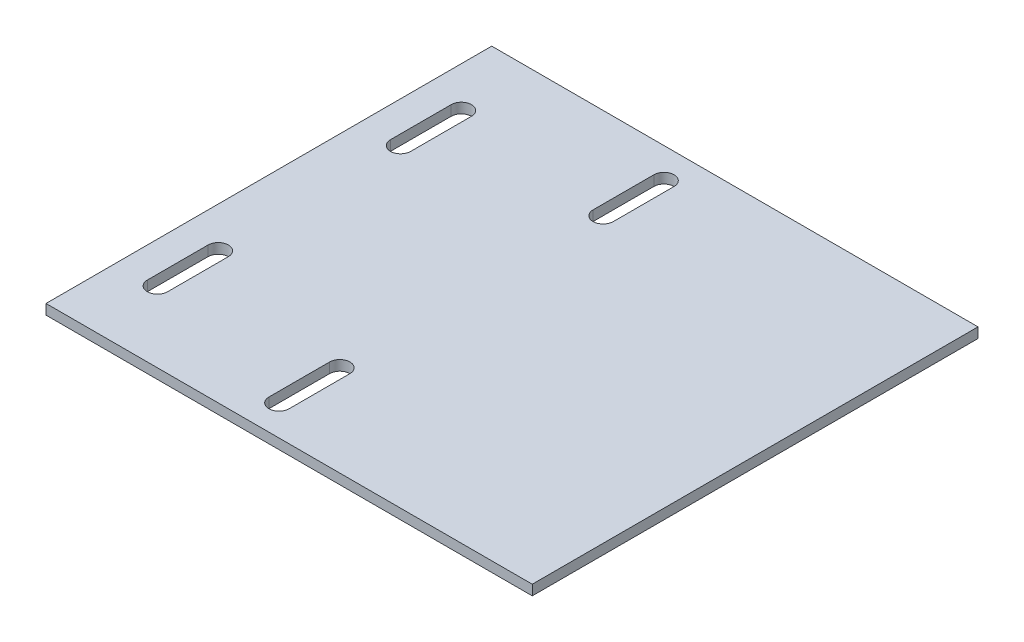
ISO-10303-21;
HEADER;
FILE_DESCRIPTION(('STEP AP214'),'2;1');
FILE_NAME('part.step','',(''),(''),'','','');
FILE_SCHEMA(('AUTOMOTIVE_DESIGN { 1 0 10303 214 1 1 1 1 }'));
ENDSEC;
DATA;
#1=APPLICATION_CONTEXT('core data for automotive mechanical design processes');
#2=APPLICATION_PROTOCOL_DEFINITION('international standard','automotive_design',2000,#1);
#3=PRODUCT_CONTEXT('',#1,'mechanical');
#4=PRODUCT('Part','Part','',(#3));
#5=PRODUCT_RELATED_PRODUCT_CATEGORY('part','',(#4));
#6=PRODUCT_DEFINITION_FORMATION('','',#4);
#7=PRODUCT_DEFINITION_CONTEXT('part definition',#1,'design');
#8=PRODUCT_DEFINITION('design','',#6,#7);
#9=PRODUCT_DEFINITION_SHAPE('','',#8);
#10=(LENGTH_UNIT() NAMED_UNIT(*) SI_UNIT(.MILLI.,.METRE.));
#11=(NAMED_UNIT(*) PLANE_ANGLE_UNIT() SI_UNIT($,.RADIAN.));
#12=(NAMED_UNIT(*) SI_UNIT($,.STERADIAN.) SOLID_ANGLE_UNIT());
#13=UNCERTAINTY_MEASURE_WITH_UNIT(LENGTH_MEASURE(1.E-05),#10,'distance_accuracy_value','');
#14=(GEOMETRIC_REPRESENTATION_CONTEXT(3) GLOBAL_UNCERTAINTY_ASSIGNED_CONTEXT((#13)) GLOBAL_UNIT_ASSIGNED_CONTEXT((#10,
#11,#12)) REPRESENTATION_CONTEXT('',''));
#15=CARTESIAN_POINT('',(0.,0.,0.));
#16=DIRECTION('',(0.,0.,1.));
#17=DIRECTION('',(1.,0.,0.));
#18=AXIS2_PLACEMENT_3D('',#15,#16,#17);
#19=CARTESIAN_POINT('',(-76.2,3.175,-69.85));
#20=DIRECTION('',(1.,0.,0.));
#21=DIRECTION('',(0.,0.,-1.));
#22=AXIS2_PLACEMENT_3D('',#19,#20,#21);
#23=PLANE('',#22);
#24=DIRECTION('',(0.,0.,1.));
#25=VECTOR('',#24,1.);
#26=CARTESIAN_POINT('',(-76.2,0.,-69.85));
#27=LINE('',#26,#25);
#28=CARTESIAN_POINT('',(-76.2,0.,-69.85));
#29=VERTEX_POINT('',#28);
#30=CARTESIAN_POINT('',(-76.2,0.,69.85));
#31=VERTEX_POINT('',#30);
#32=EDGE_CURVE('E295',#29,#31,#27,.T.);
#33=ORIENTED_EDGE('',*,*,#32,.T.);
#34=DIRECTION('',(0.,-1.,0.));
#35=VECTOR('',#34,1.);
#36=CARTESIAN_POINT('',(-76.2,3.175,69.85));
#37=LINE('',#36,#35);
#38=CARTESIAN_POINT('',(-76.2,3.175,69.85));
#39=VERTEX_POINT('',#38);
#40=EDGE_CURVE('E11',#39,#31,#37,.T.);
#41=ORIENTED_EDGE('',*,*,#40,.F.);
#42=DIRECTION('',(0.,0.,1.));
#43=VECTOR('',#42,1.);
#44=CARTESIAN_POINT('',(-76.2,3.175,-69.85));
#45=LINE('',#44,#43);
#46=CARTESIAN_POINT('',(-76.2,3.175,-69.85));
#47=VERTEX_POINT('',#46);
#48=EDGE_CURVE('E302',#47,#39,#45,.T.);
#49=ORIENTED_EDGE('',*,*,#48,.F.);
#50=DIRECTION('',(0.,-1.,0.));
#51=VECTOR('',#50,1.);
#52=CARTESIAN_POINT('',(-76.2,3.175,-69.85));
#53=LINE('',#52,#51);
#54=EDGE_CURVE('E312',#47,#29,#53,.T.);
#55=ORIENTED_EDGE('',*,*,#54,.T.);
#56=EDGE_LOOP('',(#33,#41,#49,#55));
#57=FACE_BOUND('',#56,.T.);
#58=ADVANCED_FACE('F34',(#57),#23,.F.);
#59=CARTESIAN_POINT('',(76.2,3.175,69.85));
#60=DIRECTION('',(0.,0.,-1.));
#61=DIRECTION('',(-1.,0.,0.));
#62=AXIS2_PLACEMENT_3D('',#59,#60,#61);
#63=PLANE('',#62);
#64=DIRECTION('',(1.,0.,0.));
#65=VECTOR('',#64,1.);
#66=CARTESIAN_POINT('',(76.2,0.,69.85));
#67=LINE('',#66,#65);
#68=CARTESIAN_POINT('',(76.2,0.,69.85));
#69=VERTEX_POINT('',#68);
#70=EDGE_CURVE('E315',#31,#69,#67,.T.);
#71=ORIENTED_EDGE('',*,*,#70,.T.);
#72=DIRECTION('',(0.,-1.,0.));
#73=VECTOR('',#72,1.);
#74=CARTESIAN_POINT('',(76.2,3.175,69.85));
#75=LINE('',#74,#73);
#76=CARTESIAN_POINT('',(76.2,3.175,69.85));
#77=VERTEX_POINT('',#76);
#78=EDGE_CURVE('E41',#77,#69,#75,.T.);
#79=ORIENTED_EDGE('',*,*,#78,.F.);
#80=DIRECTION('',(1.,0.,0.));
#81=VECTOR('',#80,1.);
#82=CARTESIAN_POINT('',(76.2,3.175,69.85));
#83=LINE('',#82,#81);
#84=EDGE_CURVE('E305',#39,#77,#83,.T.);
#85=ORIENTED_EDGE('',*,*,#84,.F.);
#86=ORIENTED_EDGE('',*,*,#40,.T.);
#87=EDGE_LOOP('',(#71,#79,#85,#86));
#88=FACE_BOUND('',#87,.T.);
#89=ADVANCED_FACE('F344',(#88),#63,.F.);
#90=CARTESIAN_POINT('',(76.2,3.175,-69.85));
#91=DIRECTION('',(-1.,0.,0.));
#92=DIRECTION('',(0.,0.,1.));
#93=AXIS2_PLACEMENT_3D('',#90,#91,#92);
#94=PLANE('',#93);
#95=DIRECTION('',(0.,0.,-1.));
#96=VECTOR('',#95,1.);
#97=CARTESIAN_POINT('',(76.2,0.,-69.85));
#98=LINE('',#97,#96);
#99=CARTESIAN_POINT('',(76.2,0.,-69.85));
#100=VERTEX_POINT('',#99);
#101=EDGE_CURVE('E317',#69,#100,#98,.T.);
#102=ORIENTED_EDGE('',*,*,#101,.T.);
#103=DIRECTION('',(0.,-1.,0.));
#104=VECTOR('',#103,1.);
#105=CARTESIAN_POINT('',(76.2,3.175,-69.85));
#106=LINE('',#105,#104);
#107=CARTESIAN_POINT('',(76.2,3.175,-69.85));
#108=VERTEX_POINT('',#107);
#109=EDGE_CURVE('E322',#108,#100,#106,.T.);
#110=ORIENTED_EDGE('',*,*,#109,.F.);
#111=DIRECTION('',(0.,0.,-1.));
#112=VECTOR('',#111,1.);
#113=CARTESIAN_POINT('',(76.2,3.175,-69.85));
#114=LINE('',#113,#112);
#115=EDGE_CURVE('E308',#77,#108,#114,.T.);
#116=ORIENTED_EDGE('',*,*,#115,.F.);
#117=ORIENTED_EDGE('',*,*,#78,.T.);
#118=EDGE_LOOP('',(#102,#110,#116,#117));
#119=FACE_BOUND('',#118,.T.);
#120=ADVANCED_FACE('F329',(#119),#94,.F.);
#121=CARTESIAN_POINT('',(76.2,3.175,-69.85));
#122=DIRECTION('',(0.,0.,1.));
#123=DIRECTION('',(1.,0.,0.));
#124=AXIS2_PLACEMENT_3D('',#121,#122,#123);
#125=PLANE('',#124);
#126=DIRECTION('',(-1.,0.,0.));
#127=VECTOR('',#126,1.);
#128=CARTESIAN_POINT('',(76.2,0.,-69.85));
#129=LINE('',#128,#127);
#130=EDGE_CURVE('E306',#100,#29,#129,.T.);
#131=ORIENTED_EDGE('',*,*,#130,.T.);
#132=ORIENTED_EDGE('',*,*,#54,.F.);
#133=DIRECTION('',(-1.,0.,0.));
#134=VECTOR('',#133,1.);
#135=CARTESIAN_POINT('',(76.2,3.175,-69.85));
#136=LINE('',#135,#134);
#137=EDGE_CURVE('E310',#108,#47,#136,.T.);
#138=ORIENTED_EDGE('',*,*,#137,.F.);
#139=ORIENTED_EDGE('',*,*,#109,.T.);
#140=EDGE_LOOP('',(#131,#132,#138,#139));
#141=FACE_BOUND('',#140,.T.);
#142=ADVANCED_FACE('F337',(#141),#125,.F.);
#143=CARTESIAN_POINT('',(-76.1999999999999,3.175,69.85));
#144=DIRECTION('',(0.,-1.,0.));
#145=DIRECTION('',(0.,0.,-1.));
#146=AXIS2_PLACEMENT_3D('',#143,#144,#145);
#147=PLANE('',#146);
#148=CARTESIAN_POINT('',(-63.5,3.175,-28.575));
#149=DIRECTION('',(0.,1.,0.));
#150=DIRECTION('',(0.,0.,1.));
#151=AXIS2_PLACEMENT_3D('',#148,#149,#150);
#152=CIRCLE('',#151,3.175);
#153=CARTESIAN_POINT('',(-66.675,3.175,-28.575));
#154=VERTEX_POINT('',#153);
#155=CARTESIAN_POINT('',(-60.325,3.175,-28.575));
#156=VERTEX_POINT('',#155);
#157=EDGE_CURVE('E196',#154,#156,#152,.T.);
#158=ORIENTED_EDGE('',*,*,#157,.F.);
#159=DIRECTION('',(0.,0.,1.));
#160=VECTOR('',#159,1.);
#161=CARTESIAN_POINT('',(-66.675,3.175,0.));
#162=LINE('',#161,#160);
#163=CARTESIAN_POINT('',(-66.675,3.175,-47.625));
#164=VERTEX_POINT('',#163);
#165=EDGE_CURVE('E48',#164,#154,#162,.T.);
#166=ORIENTED_EDGE('',*,*,#165,.F.);
#167=CARTESIAN_POINT('',(-63.5,3.175,-47.625));
#168=DIRECTION('',(0.,1.,0.));
#169=DIRECTION('',(0.,0.,1.));
#170=AXIS2_PLACEMENT_3D('',#167,#168,#169);
#171=CIRCLE('',#170,3.17499999999999);
#172=CARTESIAN_POINT('',(-60.325,3.175,-47.625));
#173=VERTEX_POINT('',#172);
#174=EDGE_CURVE('E187',#173,#164,#171,.T.);
#175=ORIENTED_EDGE('',*,*,#174,.F.);
#176=DIRECTION('',(0.,0.,1.));
#177=VECTOR('',#176,1.);
#178=CARTESIAN_POINT('',(-60.325,3.175,0.));
#179=LINE('',#178,#177);
#180=EDGE_CURVE('E190',#173,#156,#179,.T.);
#181=ORIENTED_EDGE('',*,*,#180,.T.);
#182=EDGE_LOOP('',(#158,#166,#175,#181));
#183=FACE_BOUND('',#182,.T.);
#184=CARTESIAN_POINT('',(-63.5,3.175,47.625));
#185=DIRECTION('',(0.,1.,0.));
#186=DIRECTION('',(0.,0.,1.));
#187=AXIS2_PLACEMENT_3D('',#184,#185,#186);
#188=CIRCLE('',#187,3.175);
#189=CARTESIAN_POINT('',(-66.675,3.175,47.625));
#190=VERTEX_POINT('',#189);
#191=CARTESIAN_POINT('',(-60.325,3.175,47.625));
#192=VERTEX_POINT('',#191);
#193=EDGE_CURVE('E221',#190,#192,#188,.T.);
#194=ORIENTED_EDGE('',*,*,#193,.F.);
#195=DIRECTION('',(0.,0.,1.));
#196=VECTOR('',#195,1.);
#197=CARTESIAN_POINT('',(-66.675,3.175,0.));
#198=LINE('',#197,#196);
#199=CARTESIAN_POINT('',(-66.675,3.175,28.575));
#200=VERTEX_POINT('',#199);
#201=EDGE_CURVE('E202',#200,#190,#198,.T.);
#202=ORIENTED_EDGE('',*,*,#201,.F.);
#203=CARTESIAN_POINT('',(-63.5,3.175,28.575));
#204=DIRECTION('',(0.,1.,0.));
#205=DIRECTION('',(0.,0.,1.));
#206=AXIS2_PLACEMENT_3D('',#203,#204,#205);
#207=CIRCLE('',#206,3.175);
#208=CARTESIAN_POINT('',(-60.325,3.175,28.575));
#209=VERTEX_POINT('',#208);
#210=EDGE_CURVE('E210',#209,#200,#207,.T.);
#211=ORIENTED_EDGE('',*,*,#210,.F.);
#212=DIRECTION('',(0.,0.,1.));
#213=VECTOR('',#212,1.);
#214=CARTESIAN_POINT('',(-60.325,3.175,0.));
#215=LINE('',#214,#213);
#216=EDGE_CURVE('E224',#209,#192,#215,.T.);
#217=ORIENTED_EDGE('',*,*,#216,.T.);
#218=EDGE_LOOP('',(#194,#202,#211,#217));
#219=FACE_BOUND('',#218,.T.);
#220=CARTESIAN_POINT('',(-12.7,3.175,-60.325));
#221=DIRECTION('',(0.,1.,0.));
#222=DIRECTION('',(0.,0.,1.));
#223=AXIS2_PLACEMENT_3D('',#220,#221,#222);
#224=CIRCLE('',#223,3.175);
#225=CARTESIAN_POINT('',(-9.52500000000001,3.175,-60.325));
#226=VERTEX_POINT('',#225);
#227=CARTESIAN_POINT('',(-15.875,3.175,-60.325));
#228=VERTEX_POINT('',#227);
#229=EDGE_CURVE('E253',#226,#228,#224,.T.);
#230=ORIENTED_EDGE('',*,*,#229,.F.);
#231=DIRECTION('',(0.,0.,-1.));
#232=VECTOR('',#231,1.);
#233=CARTESIAN_POINT('',(-9.52500000000001,3.175,0.));
#234=LINE('',#233,#232);
#235=CARTESIAN_POINT('',(-9.52500000000001,3.175,-41.275));
#236=VERTEX_POINT('',#235);
#237=EDGE_CURVE('E231',#236,#226,#234,.T.);
#238=ORIENTED_EDGE('',*,*,#237,.F.);
#239=CARTESIAN_POINT('',(-12.7,3.175,-41.275));
#240=DIRECTION('',(0.,1.,0.));
#241=DIRECTION('',(0.,0.,1.));
#242=AXIS2_PLACEMENT_3D('',#239,#240,#241);
#243=CIRCLE('',#242,3.175);
#244=CARTESIAN_POINT('',(-15.875,3.175,-41.275));
#245=VERTEX_POINT('',#244);
#246=EDGE_CURVE('E242',#245,#236,#243,.T.);
#247=ORIENTED_EDGE('',*,*,#246,.F.);
#248=DIRECTION('',(0.,0.,-1.));
#249=VECTOR('',#248,1.);
#250=CARTESIAN_POINT('',(-15.875,3.175,0.));
#251=LINE('',#250,#249);
#252=EDGE_CURVE('E256',#245,#228,#251,.T.);
#253=ORIENTED_EDGE('',*,*,#252,.T.);
#254=EDGE_LOOP('',(#230,#238,#247,#253));
#255=FACE_BOUND('',#254,.T.);
#256=CARTESIAN_POINT('',(-12.7,3.175,60.325));
#257=DIRECTION('',(0.,1.,0.));
#258=DIRECTION('',(0.,0.,1.));
#259=AXIS2_PLACEMENT_3D('',#256,#257,#258);
#260=CIRCLE('',#259,3.175);
#261=CARTESIAN_POINT('',(-15.875,3.175,60.325));
#262=VERTEX_POINT('',#261);
#263=CARTESIAN_POINT('',(-9.52499999999999,3.175,60.325));
#264=VERTEX_POINT('',#263);
#265=EDGE_CURVE('E285',#262,#264,#260,.T.);
#266=ORIENTED_EDGE('',*,*,#265,.F.);
#267=DIRECTION('',(0.,0.,1.));
#268=VECTOR('',#267,1.);
#269=CARTESIAN_POINT('',(-15.875,3.175,0.));
#270=LINE('',#269,#268);
#271=CARTESIAN_POINT('',(-15.875,3.175,41.275));
#272=VERTEX_POINT('',#271);
#273=EDGE_CURVE('E263',#272,#262,#270,.T.);
#274=ORIENTED_EDGE('',*,*,#273,.F.);
#275=CARTESIAN_POINT('',(-12.7,3.175,41.275));
#276=DIRECTION('',(0.,1.,0.));
#277=DIRECTION('',(0.,0.,1.));
#278=AXIS2_PLACEMENT_3D('',#275,#276,#277);
#279=CIRCLE('',#278,3.175);
#280=CARTESIAN_POINT('',(-9.52499999999999,3.175,41.275));
#281=VERTEX_POINT('',#280);
#282=EDGE_CURVE('E274',#281,#272,#279,.T.);
#283=ORIENTED_EDGE('',*,*,#282,.F.);
#284=DIRECTION('',(0.,0.,1.));
#285=VECTOR('',#284,1.);
#286=CARTESIAN_POINT('',(-9.52500000000001,3.175,0.));
#287=LINE('',#286,#285);
#288=EDGE_CURVE('E288',#281,#264,#287,.T.);
#289=ORIENTED_EDGE('',*,*,#288,.T.);
#290=EDGE_LOOP('',(#266,#274,#283,#289));
#291=FACE_BOUND('',#290,.T.);
#292=ORIENTED_EDGE('',*,*,#48,.T.);
#293=ORIENTED_EDGE('',*,*,#84,.T.);
#294=ORIENTED_EDGE('',*,*,#115,.T.);
#295=ORIENTED_EDGE('',*,*,#137,.T.);
#296=EDGE_LOOP('',(#292,#293,#294,#295));
#297=FACE_BOUND('',#296,.T.);
#298=ADVANCED_FACE('F343',(#183,#219,#255,#291,#297),#147,.F.);
#299=CARTESIAN_POINT('',(-76.1999999999999,0.,69.85));
#300=DIRECTION('',(0.,-1.,0.));
#301=DIRECTION('',(0.,0.,-1.));
#302=AXIS2_PLACEMENT_3D('',#299,#300,#301);
#303=PLANE('',#302);
#304=DIRECTION('',(0.,0.,1.));
#305=VECTOR('',#304,1.);
#306=CARTESIAN_POINT('',(-66.675,0.,0.));
#307=LINE('',#306,#305);
#308=CARTESIAN_POINT('',(-66.675,0.,-47.625));
#309=VERTEX_POINT('',#308);
#310=CARTESIAN_POINT('',(-66.675,0.,-28.575));
#311=VERTEX_POINT('',#310);
#312=EDGE_CURVE('E172',#309,#311,#307,.T.);
#313=ORIENTED_EDGE('',*,*,#312,.T.);
#314=CARTESIAN_POINT('',(-63.5,0.,-28.575));
#315=DIRECTION('',(0.,1.,0.));
#316=DIRECTION('',(0.,0.,1.));
#317=AXIS2_PLACEMENT_3D('',#314,#315,#316);
#318=CIRCLE('',#317,3.175);
#319=CARTESIAN_POINT('',(-60.325,0.,-28.575));
#320=VERTEX_POINT('',#319);
#321=EDGE_CURVE('E178',#311,#320,#318,.T.);
#322=ORIENTED_EDGE('',*,*,#321,.T.);
#323=DIRECTION('',(0.,0.,1.));
#324=VECTOR('',#323,1.);
#325=CARTESIAN_POINT('',(-60.325,0.,0.));
#326=LINE('',#325,#324);
#327=CARTESIAN_POINT('',(-60.325,0.,-47.625));
#328=VERTEX_POINT('',#327);
#329=EDGE_CURVE('E182',#328,#320,#326,.T.);
#330=ORIENTED_EDGE('',*,*,#329,.F.);
#331=CARTESIAN_POINT('',(-63.5,0.,-47.625));
#332=DIRECTION('',(0.,1.,0.));
#333=DIRECTION('',(0.,0.,1.));
#334=AXIS2_PLACEMENT_3D('',#331,#332,#333);
#335=CIRCLE('',#334,3.17499999999999);
#336=EDGE_CURVE('E175',#328,#309,#335,.T.);
#337=ORIENTED_EDGE('',*,*,#336,.T.);
#338=EDGE_LOOP('',(#313,#322,#330,#337));
#339=FACE_BOUND('',#338,.T.);
#340=DIRECTION('',(0.,0.,1.));
#341=VECTOR('',#340,1.);
#342=CARTESIAN_POINT('',(-66.675,0.,0.));
#343=LINE('',#342,#341);
#344=CARTESIAN_POINT('',(-66.675,0.,28.575));
#345=VERTEX_POINT('',#344);
#346=CARTESIAN_POINT('',(-66.675,0.,47.625));
#347=VERTEX_POINT('',#346);
#348=EDGE_CURVE('E206',#345,#347,#343,.T.);
#349=ORIENTED_EDGE('',*,*,#348,.T.);
#350=CARTESIAN_POINT('',(-63.5,0.,47.625));
#351=DIRECTION('',(0.,1.,0.));
#352=DIRECTION('',(0.,0.,1.));
#353=AXIS2_PLACEMENT_3D('',#350,#351,#352);
#354=CIRCLE('',#353,3.175);
#355=CARTESIAN_POINT('',(-60.325,0.,47.625));
#356=VERTEX_POINT('',#355);
#357=EDGE_CURVE('E209',#347,#356,#354,.T.);
#358=ORIENTED_EDGE('',*,*,#357,.T.);
#359=DIRECTION('',(0.,0.,1.));
#360=VECTOR('',#359,1.);
#361=CARTESIAN_POINT('',(-60.325,0.,0.));
#362=LINE('',#361,#360);
#363=CARTESIAN_POINT('',(-60.325,0.,28.575));
#364=VERTEX_POINT('',#363);
#365=EDGE_CURVE('E213',#364,#356,#362,.T.);
#366=ORIENTED_EDGE('',*,*,#365,.F.);
#367=CARTESIAN_POINT('',(-63.5,0.,28.575));
#368=DIRECTION('',(0.,1.,0.));
#369=DIRECTION('',(0.,0.,1.));
#370=AXIS2_PLACEMENT_3D('',#367,#368,#369);
#371=CIRCLE('',#370,3.175);
#372=EDGE_CURVE('E216',#364,#345,#371,.T.);
#373=ORIENTED_EDGE('',*,*,#372,.T.);
#374=EDGE_LOOP('',(#349,#358,#366,#373));
#375=FACE_BOUND('',#374,.T.);
#376=DIRECTION('',(0.,0.,-1.));
#377=VECTOR('',#376,1.);
#378=CARTESIAN_POINT('',(-9.52500000000001,0.,0.));
#379=LINE('',#378,#377);
#380=CARTESIAN_POINT('',(-9.52500000000001,0.,-41.275));
#381=VERTEX_POINT('',#380);
#382=CARTESIAN_POINT('',(-9.52500000000002,0.,-60.325));
#383=VERTEX_POINT('',#382);
#384=EDGE_CURVE('E238',#381,#383,#379,.T.);
#385=ORIENTED_EDGE('',*,*,#384,.T.);
#386=CARTESIAN_POINT('',(-12.7,0.,-60.325));
#387=DIRECTION('',(0.,1.,0.));
#388=DIRECTION('',(0.,0.,1.));
#389=AXIS2_PLACEMENT_3D('',#386,#387,#388);
#390=CIRCLE('',#389,3.175);
#391=CARTESIAN_POINT('',(-15.875,0.,-60.325));
#392=VERTEX_POINT('',#391);
#393=EDGE_CURVE('E241',#383,#392,#390,.T.);
#394=ORIENTED_EDGE('',*,*,#393,.T.);
#395=DIRECTION('',(0.,0.,-1.));
#396=VECTOR('',#395,1.);
#397=CARTESIAN_POINT('',(-15.875,0.,0.));
#398=LINE('',#397,#396);
#399=CARTESIAN_POINT('',(-15.875,0.,-41.275));
#400=VERTEX_POINT('',#399);
#401=EDGE_CURVE('E245',#400,#392,#398,.T.);
#402=ORIENTED_EDGE('',*,*,#401,.F.);
#403=CARTESIAN_POINT('',(-12.7,0.,-41.275));
#404=DIRECTION('',(0.,1.,0.));
#405=DIRECTION('',(0.,0.,1.));
#406=AXIS2_PLACEMENT_3D('',#403,#404,#405);
#407=CIRCLE('',#406,3.175);
#408=EDGE_CURVE('E248',#400,#381,#407,.T.);
#409=ORIENTED_EDGE('',*,*,#408,.T.);
#410=EDGE_LOOP('',(#385,#394,#402,#409));
#411=FACE_BOUND('',#410,.T.);
#412=DIRECTION('',(0.,0.,1.));
#413=VECTOR('',#412,1.);
#414=CARTESIAN_POINT('',(-15.875,0.,0.));
#415=LINE('',#414,#413);
#416=CARTESIAN_POINT('',(-15.875,0.,41.275));
#417=VERTEX_POINT('',#416);
#418=CARTESIAN_POINT('',(-15.875,0.,60.325));
#419=VERTEX_POINT('',#418);
#420=EDGE_CURVE('E270',#417,#419,#415,.T.);
#421=ORIENTED_EDGE('',*,*,#420,.T.);
#422=CARTESIAN_POINT('',(-12.7,0.,60.325));
#423=DIRECTION('',(0.,1.,0.));
#424=DIRECTION('',(0.,0.,1.));
#425=AXIS2_PLACEMENT_3D('',#422,#423,#424);
#426=CIRCLE('',#425,3.175);
#427=CARTESIAN_POINT('',(-9.525,0.,60.325));
#428=VERTEX_POINT('',#427);
#429=EDGE_CURVE('E273',#419,#428,#426,.T.);
#430=ORIENTED_EDGE('',*,*,#429,.T.);
#431=DIRECTION('',(0.,0.,1.));
#432=VECTOR('',#431,1.);
#433=CARTESIAN_POINT('',(-9.52500000000001,0.,0.));
#434=LINE('',#433,#432);
#435=CARTESIAN_POINT('',(-9.52499999999999,0.,41.275));
#436=VERTEX_POINT('',#435);
#437=EDGE_CURVE('E277',#436,#428,#434,.T.);
#438=ORIENTED_EDGE('',*,*,#437,.F.);
#439=CARTESIAN_POINT('',(-12.7,0.,41.275));
#440=DIRECTION('',(0.,1.,0.));
#441=DIRECTION('',(0.,0.,1.));
#442=AXIS2_PLACEMENT_3D('',#439,#440,#441);
#443=CIRCLE('',#442,3.175);
#444=EDGE_CURVE('E280',#436,#417,#443,.T.);
#445=ORIENTED_EDGE('',*,*,#444,.T.);
#446=EDGE_LOOP('',(#421,#430,#438,#445));
#447=FACE_BOUND('',#446,.T.);
#448=ORIENTED_EDGE('',*,*,#32,.F.);
#449=ORIENTED_EDGE('',*,*,#130,.F.);
#450=ORIENTED_EDGE('',*,*,#101,.F.);
#451=ORIENTED_EDGE('',*,*,#70,.F.);
#452=EDGE_LOOP('',(#448,#449,#450,#451));
#453=FACE_BOUND('',#452,.T.);
#454=ADVANCED_FACE('F184',(#339,#375,#411,#447,#453),#303,.T.);
#455=CARTESIAN_POINT('',(-15.875,0.,0.));
#456=DIRECTION('',(-1.,0.,0.));
#457=DIRECTION('',(0.,0.,1.));
#458=AXIS2_PLACEMENT_3D('',#455,#456,#457);
#459=PLANE('',#458);
#460=ORIENTED_EDGE('',*,*,#273,.T.);
#461=DIRECTION('',(0.,1.,0.));
#462=VECTOR('',#461,1.);
#463=CARTESIAN_POINT('',(-15.875,0.,60.325));
#464=LINE('',#463,#462);
#465=EDGE_CURVE('E283',#419,#262,#464,.T.);
#466=ORIENTED_EDGE('',*,*,#465,.F.);
#467=ORIENTED_EDGE('',*,*,#420,.F.);
#468=DIRECTION('',(0.,1.,0.));
#469=VECTOR('',#468,1.);
#470=CARTESIAN_POINT('',(-15.875,0.,41.275));
#471=LINE('',#470,#469);
#472=EDGE_CURVE('E293',#417,#272,#471,.T.);
#473=ORIENTED_EDGE('',*,*,#472,.T.);
#474=EDGE_LOOP('',(#460,#466,#467,#473));
#475=FACE_BOUND('',#474,.T.);
#476=ADVANCED_FACE('F356',(#475),#459,.F.);
#477=CARTESIAN_POINT('',(-12.7,0.,41.275));
#478=DIRECTION('',(0.,1.,0.));
#479=DIRECTION('',(0.,0.,1.));
#480=AXIS2_PLACEMENT_3D('',#477,#478,#479);
#481=CYLINDRICAL_SURFACE('',#480,3.175);
#482=ORIENTED_EDGE('',*,*,#282,.T.);
#483=ORIENTED_EDGE('',*,*,#472,.F.);
#484=ORIENTED_EDGE('',*,*,#444,.F.);
#485=DIRECTION('',(0.,1.,0.));
#486=VECTOR('',#485,1.);
#487=CARTESIAN_POINT('',(-9.52499999999999,0.,41.275));
#488=LINE('',#487,#486);
#489=EDGE_CURVE('E296',#436,#281,#488,.T.);
#490=ORIENTED_EDGE('',*,*,#489,.T.);
#491=EDGE_LOOP('',(#482,#483,#484,#490));
#492=FACE_BOUND('',#491,.T.);
#493=ADVANCED_FACE('F362',(#492),#481,.F.);
#494=CARTESIAN_POINT('',(-9.52500000000001,0.,0.));
#495=DIRECTION('',(-1.,0.,0.));
#496=DIRECTION('',(0.,0.,1.));
#497=AXIS2_PLACEMENT_3D('',#494,#495,#496);
#498=PLANE('',#497);
#499=ORIENTED_EDGE('',*,*,#288,.F.);
#500=ORIENTED_EDGE('',*,*,#489,.F.);
#501=ORIENTED_EDGE('',*,*,#437,.T.);
#502=DIRECTION('',(0.,1.,0.));
#503=VECTOR('',#502,1.);
#504=CARTESIAN_POINT('',(-9.52499999999999,0.,60.325));
#505=LINE('',#504,#503);
#506=EDGE_CURVE('E298',#428,#264,#505,.T.);
#507=ORIENTED_EDGE('',*,*,#506,.T.);
#508=EDGE_LOOP('',(#499,#500,#501,#507));
#509=FACE_BOUND('',#508,.T.);
#510=ADVANCED_FACE('F368',(#509),#498,.T.);
#511=CARTESIAN_POINT('',(-12.7,0.,60.325));
#512=DIRECTION('',(0.,1.,0.));
#513=DIRECTION('',(0.,0.,1.));
#514=AXIS2_PLACEMENT_3D('',#511,#512,#513);
#515=CYLINDRICAL_SURFACE('',#514,3.175);
#516=ORIENTED_EDGE('',*,*,#265,.T.);
#517=ORIENTED_EDGE('',*,*,#506,.F.);
#518=ORIENTED_EDGE('',*,*,#429,.F.);
#519=ORIENTED_EDGE('',*,*,#465,.T.);
#520=EDGE_LOOP('',(#516,#517,#518,#519));
#521=FACE_BOUND('',#520,.T.);
#522=ADVANCED_FACE('F364',(#521),#515,.F.);
#523=CARTESIAN_POINT('',(-9.52500000000001,0.,0.));
#524=DIRECTION('',(1.,0.,0.));
#525=DIRECTION('',(0.,0.,-1.));
#526=AXIS2_PLACEMENT_3D('',#523,#524,#525);
#527=PLANE('',#526);
#528=ORIENTED_EDGE('',*,*,#237,.T.);
#529=DIRECTION('',(0.,1.,0.));
#530=VECTOR('',#529,1.);
#531=CARTESIAN_POINT('',(-9.52500000000002,0.,-60.325));
#532=LINE('',#531,#530);
#533=EDGE_CURVE('E251',#383,#226,#532,.T.);
#534=ORIENTED_EDGE('',*,*,#533,.F.);
#535=ORIENTED_EDGE('',*,*,#384,.F.);
#536=DIRECTION('',(0.,1.,0.));
#537=VECTOR('',#536,1.);
#538=CARTESIAN_POINT('',(-9.52500000000001,0.,-41.275));
#539=LINE('',#538,#537);
#540=EDGE_CURVE('E261',#381,#236,#539,.T.);
#541=ORIENTED_EDGE('',*,*,#540,.T.);
#542=EDGE_LOOP('',(#528,#534,#535,#541));
#543=FACE_BOUND('',#542,.T.);
#544=ADVANCED_FACE('F367',(#543),#527,.F.);
#545=CARTESIAN_POINT('',(-12.7,0.,-41.275));
#546=DIRECTION('',(0.,1.,0.));
#547=DIRECTION('',(0.,0.,1.));
#548=AXIS2_PLACEMENT_3D('',#545,#546,#547);
#549=CYLINDRICAL_SURFACE('',#548,3.175);
#550=ORIENTED_EDGE('',*,*,#246,.T.);
#551=ORIENTED_EDGE('',*,*,#540,.F.);
#552=ORIENTED_EDGE('',*,*,#408,.F.);
#553=DIRECTION('',(0.,1.,0.));
#554=VECTOR('',#553,1.);
#555=CARTESIAN_POINT('',(-15.875,0.,-41.275));
#556=LINE('',#555,#554);
#557=EDGE_CURVE('E264',#400,#245,#556,.T.);
#558=ORIENTED_EDGE('',*,*,#557,.T.);
#559=EDGE_LOOP('',(#550,#551,#552,#558));
#560=FACE_BOUND('',#559,.T.);
#561=ADVANCED_FACE('F378',(#560),#549,.F.);
#562=CARTESIAN_POINT('',(-15.875,0.,0.));
#563=DIRECTION('',(1.,0.,0.));
#564=DIRECTION('',(0.,0.,-1.));
#565=AXIS2_PLACEMENT_3D('',#562,#563,#564);
#566=PLANE('',#565);
#567=ORIENTED_EDGE('',*,*,#252,.F.);
#568=ORIENTED_EDGE('',*,*,#557,.F.);
#569=ORIENTED_EDGE('',*,*,#401,.T.);
#570=DIRECTION('',(0.,1.,0.));
#571=VECTOR('',#570,1.);
#572=CARTESIAN_POINT('',(-15.875,0.,-60.325));
#573=LINE('',#572,#571);
#574=EDGE_CURVE('E266',#392,#228,#573,.T.);
#575=ORIENTED_EDGE('',*,*,#574,.T.);
#576=EDGE_LOOP('',(#567,#568,#569,#575));
#577=FACE_BOUND('',#576,.T.);
#578=ADVANCED_FACE('F384',(#577),#566,.T.);
#579=CARTESIAN_POINT('',(-12.7,0.,-60.325));
#580=DIRECTION('',(0.,1.,0.));
#581=DIRECTION('',(0.,0.,1.));
#582=AXIS2_PLACEMENT_3D('',#579,#580,#581);
#583=CYLINDRICAL_SURFACE('',#582,3.175);
#584=ORIENTED_EDGE('',*,*,#229,.T.);
#585=ORIENTED_EDGE('',*,*,#574,.F.);
#586=ORIENTED_EDGE('',*,*,#393,.F.);
#587=ORIENTED_EDGE('',*,*,#533,.T.);
#588=EDGE_LOOP('',(#584,#585,#586,#587));
#589=FACE_BOUND('',#588,.T.);
#590=ADVANCED_FACE('F380',(#589),#583,.F.);
#591=CARTESIAN_POINT('',(-66.675,0.,0.));
#592=DIRECTION('',(-1.,0.,0.));
#593=DIRECTION('',(0.,0.,1.));
#594=AXIS2_PLACEMENT_3D('',#591,#592,#593);
#595=PLANE('',#594);
#596=ORIENTED_EDGE('',*,*,#201,.T.);
#597=DIRECTION('',(0.,1.,0.));
#598=VECTOR('',#597,1.);
#599=CARTESIAN_POINT('',(-66.675,0.,47.625));
#600=LINE('',#599,#598);
#601=EDGE_CURVE('E219',#347,#190,#600,.T.);
#602=ORIENTED_EDGE('',*,*,#601,.F.);
#603=ORIENTED_EDGE('',*,*,#348,.F.);
#604=DIRECTION('',(0.,1.,0.));
#605=VECTOR('',#604,1.);
#606=CARTESIAN_POINT('',(-66.675,0.,28.575));
#607=LINE('',#606,#605);
#608=EDGE_CURVE('E229',#345,#200,#607,.T.);
#609=ORIENTED_EDGE('',*,*,#608,.T.);
#610=EDGE_LOOP('',(#596,#602,#603,#609));
#611=FACE_BOUND('',#610,.T.);
#612=ADVANCED_FACE('F383',(#611),#595,.F.);
#613=CARTESIAN_POINT('',(-63.5,0.,28.575));
#614=DIRECTION('',(0.,1.,0.));
#615=DIRECTION('',(0.,0.,1.));
#616=AXIS2_PLACEMENT_3D('',#613,#614,#615);
#617=CYLINDRICAL_SURFACE('',#616,3.175);
#618=ORIENTED_EDGE('',*,*,#210,.T.);
#619=ORIENTED_EDGE('',*,*,#608,.F.);
#620=ORIENTED_EDGE('',*,*,#372,.F.);
#621=DIRECTION('',(0.,1.,0.));
#622=VECTOR('',#621,1.);
#623=CARTESIAN_POINT('',(-60.325,0.,28.575));
#624=LINE('',#623,#622);
#625=EDGE_CURVE('E232',#364,#209,#624,.T.);
#626=ORIENTED_EDGE('',*,*,#625,.T.);
#627=EDGE_LOOP('',(#618,#619,#620,#626));
#628=FACE_BOUND('',#627,.T.);
#629=ADVANCED_FACE('F394',(#628),#617,.F.);
#630=CARTESIAN_POINT('',(-60.325,0.,0.));
#631=DIRECTION('',(-1.,0.,0.));
#632=DIRECTION('',(0.,0.,1.));
#633=AXIS2_PLACEMENT_3D('',#630,#631,#632);
#634=PLANE('',#633);
#635=ORIENTED_EDGE('',*,*,#216,.F.);
#636=ORIENTED_EDGE('',*,*,#625,.F.);
#637=ORIENTED_EDGE('',*,*,#365,.T.);
#638=DIRECTION('',(0.,1.,0.));
#639=VECTOR('',#638,1.);
#640=CARTESIAN_POINT('',(-60.325,0.,47.625));
#641=LINE('',#640,#639);
#642=EDGE_CURVE('E234',#356,#192,#641,.T.);
#643=ORIENTED_EDGE('',*,*,#642,.T.);
#644=EDGE_LOOP('',(#635,#636,#637,#643));
#645=FACE_BOUND('',#644,.T.);
#646=ADVANCED_FACE('F399',(#645),#634,.T.);
#647=CARTESIAN_POINT('',(-63.5,0.,47.625));
#648=DIRECTION('',(0.,1.,0.));
#649=DIRECTION('',(0.,0.,1.));
#650=AXIS2_PLACEMENT_3D('',#647,#648,#649);
#651=CYLINDRICAL_SURFACE('',#650,3.175);
#652=ORIENTED_EDGE('',*,*,#193,.T.);
#653=ORIENTED_EDGE('',*,*,#642,.F.);
#654=ORIENTED_EDGE('',*,*,#357,.F.);
#655=ORIENTED_EDGE('',*,*,#601,.T.);
#656=EDGE_LOOP('',(#652,#653,#654,#655));
#657=FACE_BOUND('',#656,.T.);
#658=ADVANCED_FACE('F396',(#657),#651,.F.);
#659=CARTESIAN_POINT('',(-66.675,0.,0.));
#660=DIRECTION('',(-1.,0.,0.));
#661=DIRECTION('',(0.,0.,1.));
#662=AXIS2_PLACEMENT_3D('',#659,#660,#661);
#663=PLANE('',#662);
#664=ORIENTED_EDGE('',*,*,#165,.T.);
#665=DIRECTION('',(0.,1.,0.));
#666=VECTOR('',#665,1.);
#667=CARTESIAN_POINT('',(-66.675,0.,-28.575));
#668=LINE('',#667,#666);
#669=EDGE_CURVE('E169',#311,#154,#668,.T.);
#670=ORIENTED_EDGE('',*,*,#669,.F.);
#671=ORIENTED_EDGE('',*,*,#312,.F.);
#672=DIRECTION('',(0.,1.,0.));
#673=VECTOR('',#672,1.);
#674=CARTESIAN_POINT('',(-66.675,0.,-47.625));
#675=LINE('',#674,#673);
#676=EDGE_CURVE('E200',#309,#164,#675,.T.);
#677=ORIENTED_EDGE('',*,*,#676,.T.);
#678=EDGE_LOOP('',(#664,#670,#671,#677));
#679=FACE_BOUND('',#678,.T.);
#680=ADVANCED_FACE('F170',(#679),#663,.F.);
#681=CARTESIAN_POINT('',(-63.5,0.,-47.625));
#682=DIRECTION('',(0.,1.,0.));
#683=DIRECTION('',(0.,0.,1.));
#684=AXIS2_PLACEMENT_3D('',#681,#682,#683);
#685=CYLINDRICAL_SURFACE('',#684,3.17499999999999);
#686=ORIENTED_EDGE('',*,*,#174,.T.);
#687=ORIENTED_EDGE('',*,*,#676,.F.);
#688=ORIENTED_EDGE('',*,*,#336,.F.);
#689=DIRECTION('',(0.,1.,0.));
#690=VECTOR('',#689,1.);
#691=CARTESIAN_POINT('',(-60.325,0.,-47.625));
#692=LINE('',#691,#690);
#693=EDGE_CURVE('E203',#328,#173,#692,.T.);
#694=ORIENTED_EDGE('',*,*,#693,.T.);
#695=EDGE_LOOP('',(#686,#687,#688,#694));
#696=FACE_BOUND('',#695,.T.);
#697=ADVANCED_FACE('F409',(#696),#685,.F.);
#698=CARTESIAN_POINT('',(-60.325,0.,0.));
#699=DIRECTION('',(-1.,0.,0.));
#700=DIRECTION('',(0.,0.,1.));
#701=AXIS2_PLACEMENT_3D('',#698,#699,#700);
#702=PLANE('',#701);
#703=ORIENTED_EDGE('',*,*,#180,.F.);
#704=ORIENTED_EDGE('',*,*,#693,.F.);
#705=ORIENTED_EDGE('',*,*,#329,.T.);
#706=DIRECTION('',(0.,1.,0.));
#707=VECTOR('',#706,1.);
#708=CARTESIAN_POINT('',(-60.325,0.,-28.575));
#709=LINE('',#708,#707);
#710=EDGE_CURVE('E56',#320,#156,#709,.T.);
#711=ORIENTED_EDGE('',*,*,#710,.T.);
#712=EDGE_LOOP('',(#703,#704,#705,#711));
#713=FACE_BOUND('',#712,.T.);
#714=ADVANCED_FACE('F412',(#713),#702,.T.);
#715=CARTESIAN_POINT('',(-63.5,0.,-28.575));
#716=DIRECTION('',(0.,1.,0.));
#717=DIRECTION('',(0.,0.,1.));
#718=AXIS2_PLACEMENT_3D('',#715,#716,#717);
#719=CYLINDRICAL_SURFACE('',#718,3.175);
#720=ORIENTED_EDGE('',*,*,#157,.T.);
#721=ORIENTED_EDGE('',*,*,#710,.F.);
#722=ORIENTED_EDGE('',*,*,#321,.F.);
#723=ORIENTED_EDGE('',*,*,#669,.T.);
#724=EDGE_LOOP('',(#720,#721,#722,#723));
#725=FACE_BOUND('',#724,.T.);
#726=ADVANCED_FACE('F179',(#725),#719,.F.);
#727=CLOSED_SHELL('',(#58,#89,#120,#142,#298,#454,#476,#493,#510,#522,#544,#561,#578,#590,#612,
#629,#646,#658,#680,#697,#714,#726));
#728=MANIFOLD_SOLID_BREP('B2',#727);
#729=ADVANCED_BREP_SHAPE_REPRESENTATION('',(#18,#728),#14);
#730=SHAPE_DEFINITION_REPRESENTATION(#9,#729);
ENDSEC;
END-ISO-10303-21;
